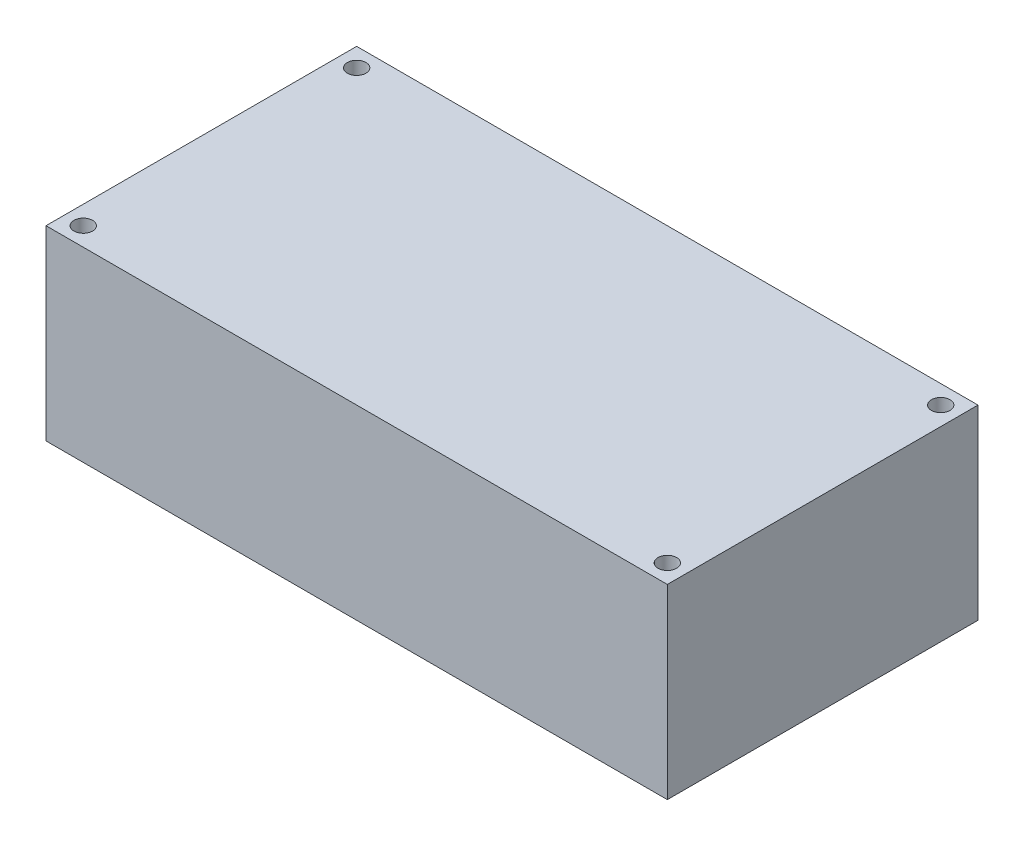
ISO-10303-21;
HEADER;
FILE_DESCRIPTION(('STEP AP214'),'2;1');
FILE_NAME('part.step','',(''),(''),'','','');
FILE_SCHEMA(('AUTOMOTIVE_DESIGN { 1 0 10303 214 1 1 1 1 }'));
ENDSEC;
DATA;
#1=APPLICATION_CONTEXT('core data for automotive mechanical design processes');
#2=APPLICATION_PROTOCOL_DEFINITION('international standard','automotive_design',2000,#1);
#3=PRODUCT_CONTEXT('',#1,'mechanical');
#4=PRODUCT('Part','Part','',(#3));
#5=PRODUCT_RELATED_PRODUCT_CATEGORY('part','',(#4));
#6=PRODUCT_DEFINITION_FORMATION('','',#4);
#7=PRODUCT_DEFINITION_CONTEXT('part definition',#1,'design');
#8=PRODUCT_DEFINITION('design','',#6,#7);
#9=PRODUCT_DEFINITION_SHAPE('','',#8);
#10=(LENGTH_UNIT() NAMED_UNIT(*) SI_UNIT(.MILLI.,.METRE.));
#11=(NAMED_UNIT(*) PLANE_ANGLE_UNIT() SI_UNIT($,.RADIAN.));
#12=(NAMED_UNIT(*) SI_UNIT($,.STERADIAN.) SOLID_ANGLE_UNIT());
#13=UNCERTAINTY_MEASURE_WITH_UNIT(LENGTH_MEASURE(1.E-05),#10,'distance_accuracy_value','');
#14=(GEOMETRIC_REPRESENTATION_CONTEXT(3) GLOBAL_UNCERTAINTY_ASSIGNED_CONTEXT((#13)) GLOBAL_UNIT_ASSIGNED_CONTEXT((#10,
#11,#12)) REPRESENTATION_CONTEXT('',''));
#15=CARTESIAN_POINT('',(0.,0.,0.));
#16=DIRECTION('',(0.,0.,1.));
#17=DIRECTION('',(1.,0.,0.));
#18=AXIS2_PLACEMENT_3D('',#15,#16,#17);
#19=CARTESIAN_POINT('',(-50.,30.,-25.));
#20=DIRECTION('',(1.,0.,0.));
#21=DIRECTION('',(0.,0.,-1.));
#22=AXIS2_PLACEMENT_3D('',#19,#20,#21);
#23=PLANE('',#22);
#24=DIRECTION('',(0.,0.,1.));
#25=VECTOR('',#24,1.);
#26=CARTESIAN_POINT('',(-50.,0.,-25.));
#27=LINE('',#26,#25);
#28=CARTESIAN_POINT('',(-50.,0.,-25.));
#29=VERTEX_POINT('',#28);
#30=CARTESIAN_POINT('',(-50.,0.,25.));
#31=VERTEX_POINT('',#30);
#32=EDGE_CURVE('E96',#29,#31,#27,.T.);
#33=ORIENTED_EDGE('',*,*,#32,.T.);
#34=DIRECTION('',(0.,-1.,0.));
#35=VECTOR('',#34,1.);
#36=CARTESIAN_POINT('',(-50.,30.,25.));
#37=LINE('',#36,#35);
#38=CARTESIAN_POINT('',(-50.,30.,25.));
#39=VERTEX_POINT('',#38);
#40=EDGE_CURVE('E11',#39,#31,#37,.T.);
#41=ORIENTED_EDGE('',*,*,#40,.F.);
#42=DIRECTION('',(0.,0.,1.));
#43=VECTOR('',#42,1.);
#44=CARTESIAN_POINT('',(-50.,30.,-25.));
#45=LINE('',#44,#43);
#46=CARTESIAN_POINT('',(-50.,30.,-25.));
#47=VERTEX_POINT('',#46);
#48=EDGE_CURVE('E84',#47,#39,#45,.T.);
#49=ORIENTED_EDGE('',*,*,#48,.F.);
#50=DIRECTION('',(0.,-1.,0.));
#51=VECTOR('',#50,1.);
#52=CARTESIAN_POINT('',(-50.,30.,-25.));
#53=LINE('',#52,#51);
#54=EDGE_CURVE('E92',#47,#29,#53,.T.);
#55=ORIENTED_EDGE('',*,*,#54,.T.);
#56=EDGE_LOOP('',(#33,#41,#49,#55));
#57=FACE_BOUND('',#56,.T.);
#58=ADVANCED_FACE('F33',(#57),#23,.F.);
#59=CARTESIAN_POINT('',(-50.,30.,25.));
#60=DIRECTION('',(0.,0.,-1.));
#61=DIRECTION('',(-1.,0.,0.));
#62=AXIS2_PLACEMENT_3D('',#59,#60,#61);
#63=PLANE('',#62);
#64=DIRECTION('',(1.,0.,0.));
#65=VECTOR('',#64,1.);
#66=CARTESIAN_POINT('',(-50.,0.,25.));
#67=LINE('',#66,#65);
#68=CARTESIAN_POINT('',(50.,0.,25.));
#69=VERTEX_POINT('',#68);
#70=EDGE_CURVE('E88',#31,#69,#67,.T.);
#71=ORIENTED_EDGE('',*,*,#70,.T.);
#72=DIRECTION('',(0.,-1.,0.));
#73=VECTOR('',#72,1.);
#74=CARTESIAN_POINT('',(50.,30.,25.));
#75=LINE('',#74,#73);
#76=CARTESIAN_POINT('',(50.,30.,25.));
#77=VERTEX_POINT('',#76);
#78=EDGE_CURVE('E41',#77,#69,#75,.T.);
#79=ORIENTED_EDGE('',*,*,#78,.F.);
#80=DIRECTION('',(1.,0.,0.));
#81=VECTOR('',#80,1.);
#82=CARTESIAN_POINT('',(-50.,30.,25.));
#83=LINE('',#82,#81);
#84=EDGE_CURVE('E79',#39,#77,#83,.T.);
#85=ORIENTED_EDGE('',*,*,#84,.F.);
#86=ORIENTED_EDGE('',*,*,#40,.T.);
#87=EDGE_LOOP('',(#71,#79,#85,#86));
#88=FACE_BOUND('',#87,.T.);
#89=ADVANCED_FACE('F87',(#88),#63,.F.);
#90=CARTESIAN_POINT('',(50.,30.,-25.));
#91=DIRECTION('',(-1.,0.,0.));
#92=DIRECTION('',(0.,0.,1.));
#93=AXIS2_PLACEMENT_3D('',#90,#91,#92);
#94=PLANE('',#93);
#95=DIRECTION('',(0.,0.,-1.));
#96=VECTOR('',#95,1.);
#97=CARTESIAN_POINT('',(50.,0.,-25.));
#98=LINE('',#97,#96);
#99=CARTESIAN_POINT('',(50.,0.,-25.));
#100=VERTEX_POINT('',#99);
#101=EDGE_CURVE('E66',#69,#100,#98,.T.);
#102=ORIENTED_EDGE('',*,*,#101,.T.);
#103=DIRECTION('',(0.,-1.,0.));
#104=VECTOR('',#103,1.);
#105=CARTESIAN_POINT('',(50.,30.,-25.));
#106=LINE('',#105,#104);
#107=CARTESIAN_POINT('',(50.,30.,-25.));
#108=VERTEX_POINT('',#107);
#109=EDGE_CURVE('E89',#108,#100,#106,.T.);
#110=ORIENTED_EDGE('',*,*,#109,.F.);
#111=DIRECTION('',(0.,0.,-1.));
#112=VECTOR('',#111,1.);
#113=CARTESIAN_POINT('',(50.,30.,-25.));
#114=LINE('',#113,#112);
#115=EDGE_CURVE('E82',#77,#108,#114,.T.);
#116=ORIENTED_EDGE('',*,*,#115,.F.);
#117=ORIENTED_EDGE('',*,*,#78,.T.);
#118=EDGE_LOOP('',(#102,#110,#116,#117));
#119=FACE_BOUND('',#118,.T.);
#120=ADVANCED_FACE('F90',(#119),#94,.F.);
#121=CARTESIAN_POINT('',(-50.,30.,-25.));
#122=DIRECTION('',(0.,0.,1.));
#123=DIRECTION('',(1.,0.,0.));
#124=AXIS2_PLACEMENT_3D('',#121,#122,#123);
#125=PLANE('',#124);
#126=DIRECTION('',(-1.,0.,0.));
#127=VECTOR('',#126,1.);
#128=CARTESIAN_POINT('',(-50.,0.,-25.));
#129=LINE('',#128,#127);
#130=EDGE_CURVE('E72',#100,#29,#129,.T.);
#131=ORIENTED_EDGE('',*,*,#130,.T.);
#132=ORIENTED_EDGE('',*,*,#54,.F.);
#133=DIRECTION('',(-1.,0.,0.));
#134=VECTOR('',#133,1.);
#135=CARTESIAN_POINT('',(-50.,30.,-25.));
#136=LINE('',#135,#134);
#137=EDGE_CURVE('E49',#108,#47,#136,.T.);
#138=ORIENTED_EDGE('',*,*,#137,.F.);
#139=ORIENTED_EDGE('',*,*,#109,.T.);
#140=EDGE_LOOP('',(#131,#132,#138,#139));
#141=FACE_BOUND('',#140,.T.);
#142=ADVANCED_FACE('F104',(#141),#125,.F.);
#143=CARTESIAN_POINT('',(0.,30.,0.));
#144=DIRECTION('',(0.,1.,0.));
#145=DIRECTION('',(0.,0.,1.));
#146=AXIS2_PLACEMENT_3D('',#143,#144,#145);
#147=PLANE('',#146);
#148=CARTESIAN_POINT('',(47.,30.,-22.));
#149=DIRECTION('',(0.,1.,0.));
#150=DIRECTION('',(0.,0.,-1.));
#151=AXIS2_PLACEMENT_3D('',#148,#149,#150);
#152=CIRCLE('',#151,1.5);
#153=CARTESIAN_POINT('',(47.,30.,-23.5));
#154=VERTEX_POINT('',#153);
#155=EDGE_CURVE('E128',#154,#154,#152,.T.);
#156=ORIENTED_EDGE('',*,*,#155,.F.);
#157=EDGE_LOOP('',(#156));
#158=FACE_BOUND('',#157,.T.);
#159=CARTESIAN_POINT('',(47.,30.,22.));
#160=DIRECTION('',(0.,1.,0.));
#161=DIRECTION('',(0.,0.,-1.));
#162=AXIS2_PLACEMENT_3D('',#159,#160,#161);
#163=CIRCLE('',#162,1.50000000000002);
#164=CARTESIAN_POINT('',(47.,30.,20.5));
#165=VERTEX_POINT('',#164);
#166=EDGE_CURVE('E122',#165,#165,#163,.T.);
#167=ORIENTED_EDGE('',*,*,#166,.F.);
#168=EDGE_LOOP('',(#167));
#169=FACE_BOUND('',#168,.T.);
#170=CARTESIAN_POINT('',(-47.,30.,22.));
#171=DIRECTION('',(0.,1.,0.));
#172=DIRECTION('',(0.,0.,1.));
#173=AXIS2_PLACEMENT_3D('',#170,#171,#172);
#174=CIRCLE('',#173,1.5);
#175=CARTESIAN_POINT('',(-47.,30.,23.5));
#176=VERTEX_POINT('',#175);
#177=EDGE_CURVE('E116',#176,#176,#174,.T.);
#178=ORIENTED_EDGE('',*,*,#177,.F.);
#179=EDGE_LOOP('',(#178));
#180=FACE_BOUND('',#179,.T.);
#181=CARTESIAN_POINT('',(-47.,30.,-22.));
#182=DIRECTION('',(0.,1.,0.));
#183=DIRECTION('',(0.,0.,1.));
#184=AXIS2_PLACEMENT_3D('',#181,#182,#183);
#185=CIRCLE('',#184,1.5);
#186=CARTESIAN_POINT('',(-47.,30.,-20.5));
#187=VERTEX_POINT('',#186);
#188=EDGE_CURVE('E110',#187,#187,#185,.T.);
#189=ORIENTED_EDGE('',*,*,#188,.F.);
#190=EDGE_LOOP('',(#189));
#191=FACE_BOUND('',#190,.T.);
#192=ORIENTED_EDGE('',*,*,#48,.T.);
#193=ORIENTED_EDGE('',*,*,#84,.T.);
#194=ORIENTED_EDGE('',*,*,#115,.T.);
#195=ORIENTED_EDGE('',*,*,#137,.T.);
#196=EDGE_LOOP('',(#192,#193,#194,#195));
#197=FACE_BOUND('',#196,.T.);
#198=ADVANCED_FACE('F80',(#158,#169,#180,#191,#197),#147,.T.);
#199=CARTESIAN_POINT('',(0.,0.,0.));
#200=DIRECTION('',(0.,1.,0.));
#201=DIRECTION('',(0.,0.,1.));
#202=AXIS2_PLACEMENT_3D('',#199,#200,#201);
#203=PLANE('',#202);
#204=CARTESIAN_POINT('',(47.,0.,-22.));
#205=DIRECTION('',(0.,1.,0.));
#206=DIRECTION('',(0.,0.,-1.));
#207=AXIS2_PLACEMENT_3D('',#204,#205,#206);
#208=CIRCLE('',#207,1.5);
#209=CARTESIAN_POINT('',(47.,0.,-23.5));
#210=VERTEX_POINT('',#209);
#211=EDGE_CURVE('E125',#210,#210,#208,.T.);
#212=ORIENTED_EDGE('',*,*,#211,.T.);
#213=EDGE_LOOP('',(#212));
#214=FACE_BOUND('',#213,.T.);
#215=CARTESIAN_POINT('',(47.,0.,22.));
#216=DIRECTION('',(0.,1.,0.));
#217=DIRECTION('',(0.,0.,-1.));
#218=AXIS2_PLACEMENT_3D('',#215,#216,#217);
#219=CIRCLE('',#218,1.50000000000002);
#220=CARTESIAN_POINT('',(47.,0.,20.5));
#221=VERTEX_POINT('',#220);
#222=EDGE_CURVE('E119',#221,#221,#219,.T.);
#223=ORIENTED_EDGE('',*,*,#222,.T.);
#224=EDGE_LOOP('',(#223));
#225=FACE_BOUND('',#224,.T.);
#226=CARTESIAN_POINT('',(-47.,0.,22.));
#227=DIRECTION('',(0.,1.,0.));
#228=DIRECTION('',(0.,0.,1.));
#229=AXIS2_PLACEMENT_3D('',#226,#227,#228);
#230=CIRCLE('',#229,1.5);
#231=CARTESIAN_POINT('',(-47.,0.,23.5));
#232=VERTEX_POINT('',#231);
#233=EDGE_CURVE('E113',#232,#232,#230,.T.);
#234=ORIENTED_EDGE('',*,*,#233,.T.);
#235=EDGE_LOOP('',(#234));
#236=FACE_BOUND('',#235,.T.);
#237=CARTESIAN_POINT('',(-47.,0.,-22.));
#238=DIRECTION('',(0.,1.,0.));
#239=DIRECTION('',(0.,0.,1.));
#240=AXIS2_PLACEMENT_3D('',#237,#238,#239);
#241=CIRCLE('',#240,1.5);
#242=CARTESIAN_POINT('',(-47.,0.,-20.5));
#243=VERTEX_POINT('',#242);
#244=EDGE_CURVE('E99',#243,#243,#241,.T.);
#245=ORIENTED_EDGE('',*,*,#244,.T.);
#246=EDGE_LOOP('',(#245));
#247=FACE_BOUND('',#246,.T.);
#248=ORIENTED_EDGE('',*,*,#32,.F.);
#249=ORIENTED_EDGE('',*,*,#130,.F.);
#250=ORIENTED_EDGE('',*,*,#101,.F.);
#251=ORIENTED_EDGE('',*,*,#70,.F.);
#252=EDGE_LOOP('',(#248,#249,#250,#251));
#253=FACE_BOUND('',#252,.T.);
#254=ADVANCED_FACE('F107',(#214,#225,#236,#247,#253),#203,.F.);
#255=CARTESIAN_POINT('',(-47.,0.,-22.));
#256=DIRECTION('',(0.,1.,0.));
#257=DIRECTION('',(0.,0.,1.));
#258=AXIS2_PLACEMENT_3D('',#255,#256,#257);
#259=CYLINDRICAL_SURFACE('',#258,1.5);
#260=ORIENTED_EDGE('',*,*,#244,.F.);
#261=EDGE_LOOP('',(#260));
#262=FACE_BOUND('',#261,.T.);
#263=ORIENTED_EDGE('',*,*,#188,.T.);
#264=EDGE_LOOP('',(#263));
#265=FACE_BOUND('',#264,.T.);
#266=ADVANCED_FACE('F152',(#262,#265),#259,.F.);
#267=CARTESIAN_POINT('',(-47.,0.,22.));
#268=DIRECTION('',(0.,1.,0.));
#269=DIRECTION('',(0.,0.,1.));
#270=AXIS2_PLACEMENT_3D('',#267,#268,#269);
#271=CYLINDRICAL_SURFACE('',#270,1.5);
#272=ORIENTED_EDGE('',*,*,#233,.F.);
#273=EDGE_LOOP('',(#272));
#274=FACE_BOUND('',#273,.T.);
#275=ORIENTED_EDGE('',*,*,#177,.T.);
#276=EDGE_LOOP('',(#275));
#277=FACE_BOUND('',#276,.T.);
#278=ADVANCED_FACE('F154',(#274,#277),#271,.F.);
#279=CARTESIAN_POINT('',(47.,0.,22.));
#280=DIRECTION('',(0.,1.,0.));
#281=DIRECTION('',(0.,0.,1.));
#282=AXIS2_PLACEMENT_3D('',#279,#280,#281);
#283=CYLINDRICAL_SURFACE('',#282,1.50000000000002);
#284=ORIENTED_EDGE('',*,*,#222,.F.);
#285=EDGE_LOOP('',(#284));
#286=FACE_BOUND('',#285,.T.);
#287=ORIENTED_EDGE('',*,*,#166,.T.);
#288=EDGE_LOOP('',(#287));
#289=FACE_BOUND('',#288,.T.);
#290=ADVANCED_FACE('F139',(#286,#289),#283,.F.);
#291=CARTESIAN_POINT('',(47.,0.,-22.));
#292=DIRECTION('',(0.,1.,0.));
#293=DIRECTION('',(0.,0.,1.));
#294=AXIS2_PLACEMENT_3D('',#291,#292,#293);
#295=CYLINDRICAL_SURFACE('',#294,1.5);
#296=ORIENTED_EDGE('',*,*,#211,.F.);
#297=EDGE_LOOP('',(#296));
#298=FACE_BOUND('',#297,.T.);
#299=ORIENTED_EDGE('',*,*,#155,.T.);
#300=EDGE_LOOP('',(#299));
#301=FACE_BOUND('',#300,.T.);
#302=ADVANCED_FACE('F136',(#298,#301),#295,.F.);
#303=CLOSED_SHELL('',(#58,#89,#120,#142,#198,#254,#266,#278,#290,#302));
#304=MANIFOLD_SOLID_BREP('B2',#303);
#305=ADVANCED_BREP_SHAPE_REPRESENTATION('',(#18,#304),#14);
#306=SHAPE_DEFINITION_REPRESENTATION(#9,#305);
ENDSEC;
END-ISO-10303-21;
